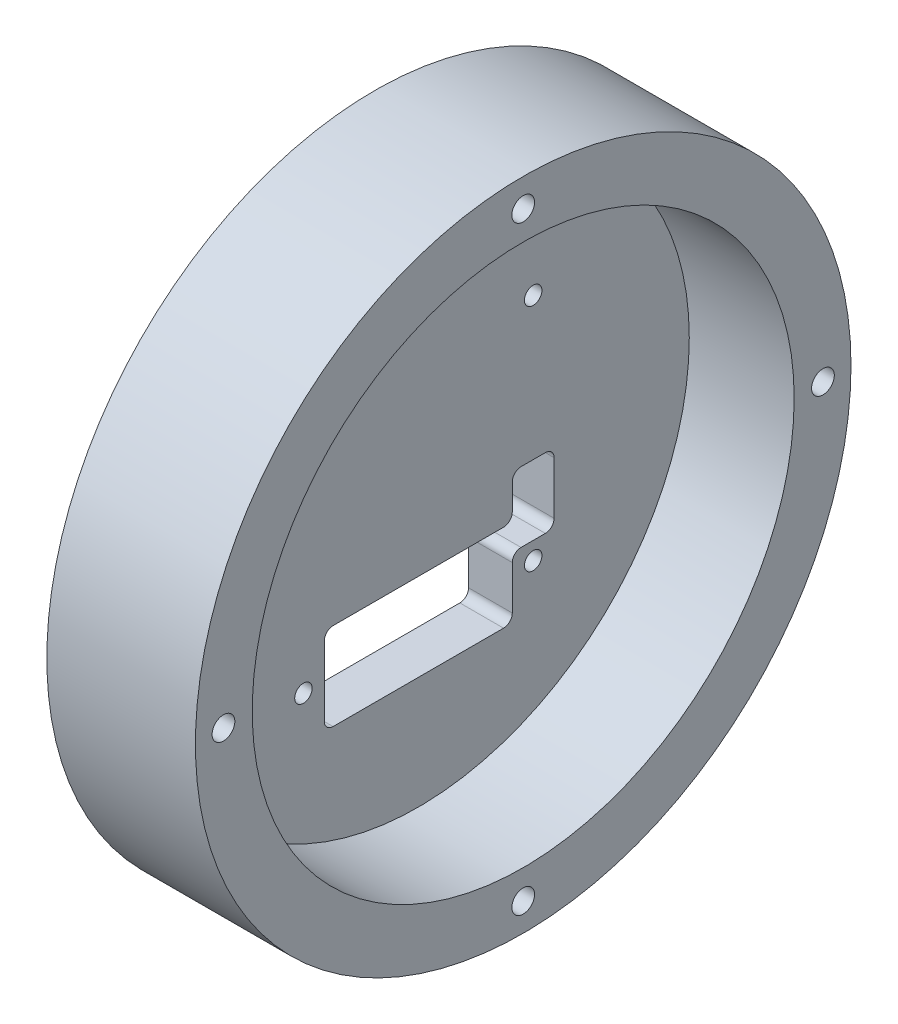
ISO-10303-21;
HEADER;
FILE_DESCRIPTION(('STEP AP214'),'2;1');
FILE_NAME('part.step','',(''),(''),'','','');
FILE_SCHEMA(('AUTOMOTIVE_DESIGN { 1 0 10303 214 1 1 1 1 }'));
ENDSEC;
DATA;
#1=APPLICATION_CONTEXT('core data for automotive mechanical design processes');
#2=APPLICATION_PROTOCOL_DEFINITION('international standard','automotive_design',2000,#1);
#3=PRODUCT_CONTEXT('',#1,'mechanical');
#4=PRODUCT('Part','Part','',(#3));
#5=PRODUCT_RELATED_PRODUCT_CATEGORY('part','',(#4));
#6=PRODUCT_DEFINITION_FORMATION('','',#4);
#7=PRODUCT_DEFINITION_CONTEXT('part definition',#1,'design');
#8=PRODUCT_DEFINITION('design','',#6,#7);
#9=PRODUCT_DEFINITION_SHAPE('','',#8);
#10=(LENGTH_UNIT() NAMED_UNIT(*) SI_UNIT(.MILLI.,.METRE.));
#11=(NAMED_UNIT(*) PLANE_ANGLE_UNIT() SI_UNIT($,.RADIAN.));
#12=(NAMED_UNIT(*) SI_UNIT($,.STERADIAN.) SOLID_ANGLE_UNIT());
#13=UNCERTAINTY_MEASURE_WITH_UNIT(LENGTH_MEASURE(1.E-05),#10,'distance_accuracy_value','');
#14=(GEOMETRIC_REPRESENTATION_CONTEXT(3) GLOBAL_UNCERTAINTY_ASSIGNED_CONTEXT((#13)) GLOBAL_UNIT_ASSIGNED_CONTEXT((#10,
#11,#12)) REPRESENTATION_CONTEXT('',''));
#15=CARTESIAN_POINT('',(0.,0.,0.));
#16=DIRECTION('',(0.,0.,1.));
#17=DIRECTION('',(1.,0.,0.));
#18=AXIS2_PLACEMENT_3D('',#15,#16,#17);
#19=CARTESIAN_POINT('',(5.,0.,0.));
#20=DIRECTION('',(1.,0.,0.));
#21=DIRECTION('',(0.,0.,-1.));
#22=AXIS2_PLACEMENT_3D('',#19,#20,#21);
#23=PLANE('',#22);
#24=CARTESIAN_POINT('',(5.,-12.14,-11.7499999999993));
#25=DIRECTION('',(-1.,0.,0.));
#26=DIRECTION('',(0.,0.,-1.));
#27=AXIS2_PLACEMENT_3D('',#24,#25,#26);
#28=CIRCLE('',#27,0.999999999999999);
#29=CARTESIAN_POINT('',(5.,-12.14,-10.7499999999993));
#30=VERTEX_POINT('',#29);
#31=CARTESIAN_POINT('',(5.,-11.14,-11.7499999999993));
#32=VERTEX_POINT('',#31);
#33=EDGE_CURVE('E49',#30,#32,#28,.T.);
#34=ORIENTED_EDGE('',*,*,#33,.F.);
#35=DIRECTION('',(0.,1.,0.));
#36=VECTOR('',#35,1.);
#37=CARTESIAN_POINT('',(5.,-12.14,-10.7499999999993));
#38=LINE('',#37,#36);
#39=CARTESIAN_POINT('',(5.,-17.14,-10.7499999999993));
#40=VERTEX_POINT('',#39);
#41=EDGE_CURVE('E166',#40,#30,#38,.T.);
#42=ORIENTED_EDGE('',*,*,#41,.F.);
#43=CARTESIAN_POINT('',(5.,-17.14,-9.74999999999926));
#44=DIRECTION('',(1.,0.,0.));
#45=DIRECTION('',(0.,0.,1.));
#46=AXIS2_PLACEMENT_3D('',#43,#44,#45);
#47=CIRCLE('',#46,1.);
#48=CARTESIAN_POINT('',(5.,-18.14,-9.74999999999926));
#49=VERTEX_POINT('',#48);
#50=EDGE_CURVE('E169',#49,#40,#47,.T.);
#51=ORIENTED_EDGE('',*,*,#50,.F.);
#52=DIRECTION('',(0.,0.,-1.));
#53=VECTOR('',#52,1.);
#54=CARTESIAN_POINT('',(5.,-18.14,-9.74999999999926));
#55=LINE('',#54,#53);
#56=CARTESIAN_POINT('',(5.,-18.14,9.75000000000074));
#57=VERTEX_POINT('',#56);
#58=EDGE_CURVE('E245',#57,#49,#55,.T.);
#59=ORIENTED_EDGE('',*,*,#58,.F.);
#60=CARTESIAN_POINT('',(5.,-17.14,9.75000000000074));
#61=DIRECTION('',(1.,0.,0.));
#62=DIRECTION('',(0.,0.,1.));
#63=AXIS2_PLACEMENT_3D('',#60,#61,#62);
#64=CIRCLE('',#63,1.);
#65=CARTESIAN_POINT('',(5.,-17.14,10.7500000000007));
#66=VERTEX_POINT('',#65);
#67=EDGE_CURVE('E242',#66,#57,#64,.T.);
#68=ORIENTED_EDGE('',*,*,#67,.F.);
#69=DIRECTION('',(0.,-1.,0.));
#70=VECTOR('',#69,1.);
#71=CARTESIAN_POINT('',(5.,-9.14,10.7500000000007));
#72=LINE('',#71,#70);
#73=CARTESIAN_POINT('',(5.,-9.14,10.7500000000007));
#74=VERTEX_POINT('',#73);
#75=EDGE_CURVE('E239',#74,#66,#72,.T.);
#76=ORIENTED_EDGE('',*,*,#75,.F.);
#77=CARTESIAN_POINT('',(5.,-9.14,9.75000000000074));
#78=DIRECTION('',(1.,0.,0.));
#79=DIRECTION('',(0.,0.,1.));
#80=AXIS2_PLACEMENT_3D('',#77,#78,#79);
#81=CIRCLE('',#80,0.999999999999997);
#82=CARTESIAN_POINT('',(5.,-8.14,9.75000000000074));
#83=VERTEX_POINT('',#82);
#84=EDGE_CURVE('E236',#83,#74,#81,.T.);
#85=ORIENTED_EDGE('',*,*,#84,.F.);
#86=DIRECTION('',(0.,0.,1.));
#87=VECTOR('',#86,1.);
#88=CARTESIAN_POINT('',(5.,-8.14,-9.74999999999926));
#89=LINE('',#88,#87);
#90=CARTESIAN_POINT('',(5.,-8.14,-9.74999999999926));
#91=VERTEX_POINT('',#90);
#92=EDGE_CURVE('E233',#91,#83,#89,.T.);
#93=ORIENTED_EDGE('',*,*,#92,.F.);
#94=CARTESIAN_POINT('',(5.,-7.14,-9.74999999999926));
#95=DIRECTION('',(-1.,0.,0.));
#96=DIRECTION('',(0.,0.,-1.));
#97=AXIS2_PLACEMENT_3D('',#94,#95,#96);
#98=CIRCLE('',#97,1.);
#99=CARTESIAN_POINT('',(5.,-7.14,-10.7499999999993));
#100=VERTEX_POINT('',#99);
#101=EDGE_CURVE('E230',#100,#91,#98,.T.);
#102=ORIENTED_EDGE('',*,*,#101,.F.);
#103=DIRECTION('',(0.,-1.,0.));
#104=VECTOR('',#103,1.);
#105=CARTESIAN_POINT('',(5.,-4.14,-10.7499999999993));
#106=LINE('',#105,#104);
#107=CARTESIAN_POINT('',(5.,-4.14,-10.7499999999993));
#108=VERTEX_POINT('',#107);
#109=EDGE_CURVE('E227',#108,#100,#106,.T.);
#110=ORIENTED_EDGE('',*,*,#109,.F.);
#111=CARTESIAN_POINT('',(5.,-4.14,-11.7499999999993));
#112=DIRECTION('',(1.,0.,0.));
#113=DIRECTION('',(0.,0.,1.));
#114=AXIS2_PLACEMENT_3D('',#111,#112,#113);
#115=CIRCLE('',#114,1.);
#116=CARTESIAN_POINT('',(5.,-3.14,-11.7499999999993));
#117=VERTEX_POINT('',#116);
#118=EDGE_CURVE('E224',#117,#108,#115,.T.);
#119=ORIENTED_EDGE('',*,*,#118,.F.);
#120=DIRECTION('',(0.,0.,1.));
#121=VECTOR('',#120,1.);
#122=CARTESIAN_POINT('',(5.,-3.14,-14.5299999999993));
#123=LINE('',#122,#121);
#124=CARTESIAN_POINT('',(5.,-3.14,-14.5299999999993));
#125=VERTEX_POINT('',#124);
#126=EDGE_CURVE('E221',#125,#117,#123,.T.);
#127=ORIENTED_EDGE('',*,*,#126,.F.);
#128=CARTESIAN_POINT('',(5.,-4.14,-14.5299999999993));
#129=DIRECTION('',(1.,0.,0.));
#130=DIRECTION('',(0.,0.,-1.));
#131=AXIS2_PLACEMENT_3D('',#128,#129,#130);
#132=CIRCLE('',#131,1.);
#133=CARTESIAN_POINT('',(5.,-4.14,-15.5299999999993));
#134=VERTEX_POINT('',#133);
#135=EDGE_CURVE('E218',#134,#125,#132,.T.);
#136=ORIENTED_EDGE('',*,*,#135,.F.);
#137=DIRECTION('',(0.,1.,0.));
#138=VECTOR('',#137,1.);
#139=CARTESIAN_POINT('',(5.,-4.14,-15.5299999999993));
#140=LINE('',#139,#138);
#141=CARTESIAN_POINT('',(5.,-10.14,-15.5299999999993));
#142=VERTEX_POINT('',#141);
#143=EDGE_CURVE('E215',#142,#134,#140,.T.);
#144=ORIENTED_EDGE('',*,*,#143,.F.);
#145=CARTESIAN_POINT('',(5.,-10.14,-14.5299999999993));
#146=DIRECTION('',(1.,0.,0.));
#147=DIRECTION('',(0.,0.,1.));
#148=AXIS2_PLACEMENT_3D('',#145,#146,#147);
#149=CIRCLE('',#148,0.999999999999999);
#150=CARTESIAN_POINT('',(5.,-11.14,-14.5299999999993));
#151=VERTEX_POINT('',#150);
#152=EDGE_CURVE('E212',#151,#142,#149,.T.);
#153=ORIENTED_EDGE('',*,*,#152,.F.);
#154=DIRECTION('',(0.,0.,-1.));
#155=VECTOR('',#154,1.);
#156=CARTESIAN_POINT('',(5.,-11.14,-14.5299999999993));
#157=LINE('',#156,#155);
#158=EDGE_CURVE('E210',#32,#151,#157,.T.);
#159=ORIENTED_EDGE('',*,*,#158,.F.);
#160=EDGE_LOOP('',(#34,#42,#51,#59,#68,#76,#85,#93,#102,#110,#119,#127,#136,#144,#153,#159));
#161=FACE_BOUND('',#160,.T.);
#162=CARTESIAN_POINT('',(5.,13.14,-13.14));
#163=DIRECTION('',(-1.,0.,0.));
#164=DIRECTION('',(0.,0.,1.));
#165=AXIS2_PLACEMENT_3D('',#162,#163,#164);
#166=CIRCLE('',#165,1.);
#167=CARTESIAN_POINT('',(5.,13.14,-12.14));
#168=VERTEX_POINT('',#167);
#169=EDGE_CURVE('E328',#168,#168,#166,.T.);
#170=ORIENTED_EDGE('',*,*,#169,.T.);
#171=EDGE_LOOP('',(#170));
#172=FACE_BOUND('',#171,.T.);
#173=CARTESIAN_POINT('',(5.,13.1400000000007,13.14));
#174=DIRECTION('',(-1.,0.,0.));
#175=DIRECTION('',(0.,0.,1.));
#176=AXIS2_PLACEMENT_3D('',#173,#174,#175);
#177=CIRCLE('',#176,1.00000000000076);
#178=CARTESIAN_POINT('',(5.,13.1400000000007,14.1400000000008));
#179=VERTEX_POINT('',#178);
#180=EDGE_CURVE('E310',#179,#179,#177,.T.);
#181=ORIENTED_EDGE('',*,*,#180,.T.);
#182=EDGE_LOOP('',(#181));
#183=FACE_BOUND('',#182,.T.);
#184=CARTESIAN_POINT('',(5.,-13.1399999999993,13.1400000000007));
#185=DIRECTION('',(-1.,0.,0.));
#186=DIRECTION('',(0.,0.,1.));
#187=AXIS2_PLACEMENT_3D('',#184,#185,#186);
#188=CIRCLE('',#187,1.00000000000104);
#189=CARTESIAN_POINT('',(5.,-13.1399999999993,14.1400000000018));
#190=VERTEX_POINT('',#189);
#191=EDGE_CURVE('E317',#190,#190,#188,.T.);
#192=ORIENTED_EDGE('',*,*,#191,.T.);
#193=EDGE_LOOP('',(#192));
#194=FACE_BOUND('',#193,.T.);
#195=CARTESIAN_POINT('',(5.,-13.14,-13.1399999999993));
#196=DIRECTION('',(-1.,0.,0.));
#197=DIRECTION('',(0.,0.,1.));
#198=AXIS2_PLACEMENT_3D('',#195,#196,#197);
#199=CIRCLE('',#198,1.00000000000039);
#200=CARTESIAN_POINT('',(5.,-13.14,-12.1399999999989));
#201=VERTEX_POINT('',#200);
#202=EDGE_CURVE('E323',#201,#201,#199,.T.);
#203=ORIENTED_EDGE('',*,*,#202,.T.);
#204=EDGE_LOOP('',(#203));
#205=FACE_BOUND('',#204,.T.);
#206=CARTESIAN_POINT('',(5.,0.,0.));
#207=DIRECTION('',(1.,0.,0.));
#208=DIRECTION('',(0.,0.,-1.));
#209=AXIS2_PLACEMENT_3D('',#206,#207,#208);
#210=CIRCLE('',#209,31.);
#211=CARTESIAN_POINT('',(5.,0.,-31.));
#212=VERTEX_POINT('',#211);
#213=EDGE_CURVE('E12',#212,#212,#210,.F.);
#214=ORIENTED_EDGE('',*,*,#213,.F.);
#215=EDGE_LOOP('',(#214));
#216=FACE_BOUND('',#215,.T.);
#217=ADVANCED_FACE('F34',(#161,#172,#183,#194,#205,#216),#23,.T.);
#218=CARTESIAN_POINT('',(5.,0.,0.));
#219=DIRECTION('',(-1.,0.,0.));
#220=DIRECTION('',(0.,0.,1.));
#221=AXIS2_PLACEMENT_3D('',#218,#219,#220);
#222=CYLINDRICAL_SURFACE('',#221,37.5);
#223=CARTESIAN_POINT('',(0.,0.,0.));
#224=DIRECTION('',(1.,0.,0.));
#225=DIRECTION('',(0.,0.,-1.));
#226=AXIS2_PLACEMENT_3D('',#223,#224,#225);
#227=CIRCLE('',#226,37.5);
#228=CARTESIAN_POINT('',(0.,0.,-37.5));
#229=VERTEX_POINT('',#228);
#230=EDGE_CURVE('E42',#229,#229,#227,.T.);
#231=ORIENTED_EDGE('',*,*,#230,.T.);
#232=EDGE_LOOP('',(#231));
#233=FACE_BOUND('',#232,.T.);
#234=CARTESIAN_POINT('',(17.,0.,0.));
#235=DIRECTION('',(1.,0.,0.));
#236=DIRECTION('',(0.,0.,-1.));
#237=AXIS2_PLACEMENT_3D('',#234,#235,#236);
#238=CIRCLE('',#237,37.5);
#239=CARTESIAN_POINT('',(17.,0.,-37.5));
#240=VERTEX_POINT('',#239);
#241=EDGE_CURVE('E306',#240,#240,#238,.T.);
#242=ORIENTED_EDGE('',*,*,#241,.F.);
#243=EDGE_LOOP('',(#242));
#244=FACE_BOUND('',#243,.T.);
#245=ADVANCED_FACE('F36',(#233,#244),#222,.T.);
#246=CARTESIAN_POINT('',(0.,0.,0.));
#247=DIRECTION('',(1.,0.,0.));
#248=DIRECTION('',(0.,0.,-1.));
#249=AXIS2_PLACEMENT_3D('',#246,#247,#248);
#250=PLANE('',#249);
#251=DIRECTION('',(0.,1.,0.));
#252=VECTOR('',#251,1.);
#253=CARTESIAN_POINT('',(0.,-12.14,-10.7499999999993));
#254=LINE('',#253,#252);
#255=CARTESIAN_POINT('',(0.,-17.14,-10.7499999999993));
#256=VERTEX_POINT('',#255);
#257=CARTESIAN_POINT('',(0.,-12.14,-10.7499999999993));
#258=VERTEX_POINT('',#257);
#259=EDGE_CURVE('E155',#256,#258,#254,.T.);
#260=ORIENTED_EDGE('',*,*,#259,.T.);
#261=CARTESIAN_POINT('',(0.,-12.14,-11.7499999999993));
#262=DIRECTION('',(-1.,0.,0.));
#263=DIRECTION('',(0.,0.,-1.));
#264=AXIS2_PLACEMENT_3D('',#261,#262,#263);
#265=CIRCLE('',#264,0.999999999999999);
#266=CARTESIAN_POINT('',(0.,-11.14,-11.7499999999993));
#267=VERTEX_POINT('',#266);
#268=EDGE_CURVE('E149',#258,#267,#265,.T.);
#269=ORIENTED_EDGE('',*,*,#268,.T.);
#270=DIRECTION('',(0.,0.,-1.));
#271=VECTOR('',#270,1.);
#272=CARTESIAN_POINT('',(0.,-11.14,-14.5299999999993));
#273=LINE('',#272,#271);
#274=CARTESIAN_POINT('',(0.,-11.14,-14.5299999999993));
#275=VERTEX_POINT('',#274);
#276=EDGE_CURVE('E158',#267,#275,#273,.T.);
#277=ORIENTED_EDGE('',*,*,#276,.T.);
#278=CARTESIAN_POINT('',(0.,-10.14,-14.5299999999993));
#279=DIRECTION('',(1.,0.,0.));
#280=DIRECTION('',(0.,0.,1.));
#281=AXIS2_PLACEMENT_3D('',#278,#279,#280);
#282=CIRCLE('',#281,0.999999999999999);
#283=CARTESIAN_POINT('',(0.,-10.14,-15.5299999999993));
#284=VERTEX_POINT('',#283);
#285=EDGE_CURVE('E57',#275,#284,#282,.T.);
#286=ORIENTED_EDGE('',*,*,#285,.T.);
#287=DIRECTION('',(0.,1.,0.));
#288=VECTOR('',#287,1.);
#289=CARTESIAN_POINT('',(0.,-4.14,-15.5299999999993));
#290=LINE('',#289,#288);
#291=CARTESIAN_POINT('',(0.,-4.14,-15.5299999999993));
#292=VERTEX_POINT('',#291);
#293=EDGE_CURVE('E173',#284,#292,#290,.T.);
#294=ORIENTED_EDGE('',*,*,#293,.T.);
#295=CARTESIAN_POINT('',(0.,-4.14,-14.5299999999993));
#296=DIRECTION('',(1.,0.,0.));
#297=DIRECTION('',(0.,0.,-1.));
#298=AXIS2_PLACEMENT_3D('',#295,#296,#297);
#299=CIRCLE('',#298,1.);
#300=CARTESIAN_POINT('',(0.,-3.14,-14.5299999999993));
#301=VERTEX_POINT('',#300);
#302=EDGE_CURVE('E176',#292,#301,#299,.T.);
#303=ORIENTED_EDGE('',*,*,#302,.T.);
#304=DIRECTION('',(0.,0.,1.));
#305=VECTOR('',#304,1.);
#306=CARTESIAN_POINT('',(0.,-3.14,-14.5299999999993));
#307=LINE('',#306,#305);
#308=CARTESIAN_POINT('',(0.,-3.14,-11.7499999999993));
#309=VERTEX_POINT('',#308);
#310=EDGE_CURVE('E179',#301,#309,#307,.T.);
#311=ORIENTED_EDGE('',*,*,#310,.T.);
#312=CARTESIAN_POINT('',(0.,-4.14,-11.7499999999993));
#313=DIRECTION('',(1.,0.,0.));
#314=DIRECTION('',(0.,0.,1.));
#315=AXIS2_PLACEMENT_3D('',#312,#313,#314);
#316=CIRCLE('',#315,1.);
#317=CARTESIAN_POINT('',(0.,-4.14,-10.7499999999993));
#318=VERTEX_POINT('',#317);
#319=EDGE_CURVE('E182',#309,#318,#316,.T.);
#320=ORIENTED_EDGE('',*,*,#319,.T.);
#321=DIRECTION('',(0.,-1.,0.));
#322=VECTOR('',#321,1.);
#323=CARTESIAN_POINT('',(0.,-4.14,-10.7499999999993));
#324=LINE('',#323,#322);
#325=CARTESIAN_POINT('',(0.,-7.14,-10.7499999999993));
#326=VERTEX_POINT('',#325);
#327=EDGE_CURVE('E185',#318,#326,#324,.T.);
#328=ORIENTED_EDGE('',*,*,#327,.T.);
#329=CARTESIAN_POINT('',(0.,-7.14,-9.74999999999926));
#330=DIRECTION('',(-1.,0.,0.));
#331=DIRECTION('',(0.,0.,-1.));
#332=AXIS2_PLACEMENT_3D('',#329,#330,#331);
#333=CIRCLE('',#332,1.);
#334=CARTESIAN_POINT('',(0.,-8.14,-9.74999999999926));
#335=VERTEX_POINT('',#334);
#336=EDGE_CURVE('E188',#326,#335,#333,.T.);
#337=ORIENTED_EDGE('',*,*,#336,.T.);
#338=DIRECTION('',(0.,0.,1.));
#339=VECTOR('',#338,1.);
#340=CARTESIAN_POINT('',(0.,-8.14,-9.74999999999926));
#341=LINE('',#340,#339);
#342=CARTESIAN_POINT('',(0.,-8.14,9.75000000000074));
#343=VERTEX_POINT('',#342);
#344=EDGE_CURVE('E191',#335,#343,#341,.T.);
#345=ORIENTED_EDGE('',*,*,#344,.T.);
#346=CARTESIAN_POINT('',(0.,-9.14,9.75000000000074));
#347=DIRECTION('',(1.,0.,0.));
#348=DIRECTION('',(0.,0.,1.));
#349=AXIS2_PLACEMENT_3D('',#346,#347,#348);
#350=CIRCLE('',#349,0.999999999999997);
#351=CARTESIAN_POINT('',(0.,-9.14,10.7500000000007));
#352=VERTEX_POINT('',#351);
#353=EDGE_CURVE('E194',#343,#352,#350,.T.);
#354=ORIENTED_EDGE('',*,*,#353,.T.);
#355=DIRECTION('',(0.,-1.,0.));
#356=VECTOR('',#355,1.);
#357=CARTESIAN_POINT('',(0.,-9.14,10.7500000000007));
#358=LINE('',#357,#356);
#359=CARTESIAN_POINT('',(0.,-17.14,10.7500000000007));
#360=VERTEX_POINT('',#359);
#361=EDGE_CURVE('E197',#352,#360,#358,.T.);
#362=ORIENTED_EDGE('',*,*,#361,.T.);
#363=CARTESIAN_POINT('',(0.,-17.14,9.75000000000074));
#364=DIRECTION('',(1.,0.,0.));
#365=DIRECTION('',(0.,0.,1.));
#366=AXIS2_PLACEMENT_3D('',#363,#364,#365);
#367=CIRCLE('',#366,1.);
#368=CARTESIAN_POINT('',(0.,-18.14,9.75000000000074));
#369=VERTEX_POINT('',#368);
#370=EDGE_CURVE('E200',#360,#369,#367,.T.);
#371=ORIENTED_EDGE('',*,*,#370,.T.);
#372=DIRECTION('',(0.,0.,-1.));
#373=VECTOR('',#372,1.);
#374=CARTESIAN_POINT('',(0.,-18.14,-9.74999999999926));
#375=LINE('',#374,#373);
#376=CARTESIAN_POINT('',(0.,-18.14,-9.74999999999926));
#377=VERTEX_POINT('',#376);
#378=EDGE_CURVE('E203',#369,#377,#375,.T.);
#379=ORIENTED_EDGE('',*,*,#378,.T.);
#380=CARTESIAN_POINT('',(0.,-17.14,-9.74999999999926));
#381=DIRECTION('',(1.,0.,0.));
#382=DIRECTION('',(0.,0.,1.));
#383=AXIS2_PLACEMENT_3D('',#380,#381,#382);
#384=CIRCLE('',#383,1.);
#385=EDGE_CURVE('E206',#377,#256,#384,.T.);
#386=ORIENTED_EDGE('',*,*,#385,.T.);
#387=EDGE_LOOP('',(#260,#269,#277,#286,#294,#303,#311,#320,#328,#337,#345,#354,#362,#371,#379,#386));
#388=FACE_BOUND('',#387,.T.);
#389=CARTESIAN_POINT('',(0.,34.29,0.));
#390=DIRECTION('',(1.,0.,0.));
#391=DIRECTION('',(0.,0.,-1.));
#392=AXIS2_PLACEMENT_3D('',#389,#390,#391);
#393=CIRCLE('',#392,1.3);
#394=CARTESIAN_POINT('',(0.,34.29,-1.3));
#395=VERTEX_POINT('',#394);
#396=EDGE_CURVE('E283',#395,#395,#393,.T.);
#397=ORIENTED_EDGE('',*,*,#396,.T.);
#398=EDGE_LOOP('',(#397));
#399=FACE_BOUND('',#398,.T.);
#400=CARTESIAN_POINT('',(0.,9.70381102494277E-13,-34.290000000001));
#401=DIRECTION('',(1.,0.,0.));
#402=DIRECTION('',(0.,0.,-1.));
#403=AXIS2_PLACEMENT_3D('',#400,#401,#402);
#404=CIRCLE('',#403,1.30000000000076);
#405=CARTESIAN_POINT('',(0.,9.70381102494277E-13,-35.5900000000017));
#406=VERTEX_POINT('',#405);
#407=EDGE_CURVE('E284',#406,#406,#404,.T.);
#408=ORIENTED_EDGE('',*,*,#407,.T.);
#409=EDGE_LOOP('',(#408));
#410=FACE_BOUND('',#409,.T.);
#411=CARTESIAN_POINT('',(0.,-34.29,-1.94076220498855E-12));
#412=DIRECTION('',(1.,0.,0.));
#413=DIRECTION('',(0.,0.,-1.));
#414=AXIS2_PLACEMENT_3D('',#411,#412,#413);
#415=CIRCLE('',#414,1.30000000000209);
#416=CARTESIAN_POINT('',(0.,-34.29,-1.30000000000403));
#417=VERTEX_POINT('',#416);
#418=EDGE_CURVE('E291',#417,#417,#415,.T.);
#419=ORIENTED_EDGE('',*,*,#418,.T.);
#420=EDGE_LOOP('',(#419));
#421=FACE_BOUND('',#420,.T.);
#422=CARTESIAN_POINT('',(0.,-9.74580416368553E-13,34.289999999999));
#423=DIRECTION('',(1.,0.,0.));
#424=DIRECTION('',(0.,0.,-1.));
#425=AXIS2_PLACEMENT_3D('',#422,#423,#424);
#426=CIRCLE('',#425,1.30000000000156);
#427=CARTESIAN_POINT('',(0.,-9.74580416368553E-13,32.9899999999975));
#428=VERTEX_POINT('',#427);
#429=EDGE_CURVE('E297',#428,#428,#426,.T.);
#430=ORIENTED_EDGE('',*,*,#429,.T.);
#431=EDGE_LOOP('',(#430));
#432=FACE_BOUND('',#431,.T.);
#433=CARTESIAN_POINT('',(0.,-13.14,-13.1399999999993));
#434=DIRECTION('',(-1.,0.,0.));
#435=DIRECTION('',(0.,0.,1.));
#436=AXIS2_PLACEMENT_3D('',#433,#434,#435);
#437=CIRCLE('',#436,1.00000000000039);
#438=CARTESIAN_POINT('',(0.,-13.14,-12.1399999999989));
#439=VERTEX_POINT('',#438);
#440=EDGE_CURVE('E309',#439,#439,#437,.T.);
#441=ORIENTED_EDGE('',*,*,#440,.F.);
#442=EDGE_LOOP('',(#441));
#443=FACE_BOUND('',#442,.T.);
#444=CARTESIAN_POINT('',(0.,-13.1399999999993,13.1400000000007));
#445=DIRECTION('',(-1.,0.,0.));
#446=DIRECTION('',(0.,0.,1.));
#447=AXIS2_PLACEMENT_3D('',#444,#445,#446);
#448=CIRCLE('',#447,1.00000000000104);
#449=CARTESIAN_POINT('',(0.,-13.1399999999993,14.1400000000018));
#450=VERTEX_POINT('',#449);
#451=EDGE_CURVE('E320',#450,#450,#448,.T.);
#452=ORIENTED_EDGE('',*,*,#451,.F.);
#453=EDGE_LOOP('',(#452));
#454=FACE_BOUND('',#453,.T.);
#455=CARTESIAN_POINT('',(0.,13.1400000000007,13.14));
#456=DIRECTION('',(-1.,0.,0.));
#457=DIRECTION('',(0.,0.,1.));
#458=AXIS2_PLACEMENT_3D('',#455,#456,#457);
#459=CIRCLE('',#458,1.00000000000076);
#460=CARTESIAN_POINT('',(0.,13.1400000000007,14.1400000000008));
#461=VERTEX_POINT('',#460);
#462=EDGE_CURVE('E314',#461,#461,#459,.T.);
#463=ORIENTED_EDGE('',*,*,#462,.F.);
#464=EDGE_LOOP('',(#463));
#465=FACE_BOUND('',#464,.T.);
#466=CARTESIAN_POINT('',(0.,13.14,-13.14));
#467=DIRECTION('',(-1.,0.,0.));
#468=DIRECTION('',(0.,0.,1.));
#469=AXIS2_PLACEMENT_3D('',#466,#467,#468);
#470=CIRCLE('',#469,1.);
#471=CARTESIAN_POINT('',(0.,13.14,-12.14));
#472=VERTEX_POINT('',#471);
#473=EDGE_CURVE('E313',#472,#472,#470,.T.);
#474=ORIENTED_EDGE('',*,*,#473,.F.);
#475=EDGE_LOOP('',(#474));
#476=FACE_BOUND('',#475,.T.);
#477=ORIENTED_EDGE('',*,*,#230,.F.);
#478=EDGE_LOOP('',(#477));
#479=FACE_BOUND('',#478,.T.);
#480=ADVANCED_FACE('F162',(#388,#399,#410,#421,#432,#443,#454,#465,#476,#479),#250,.F.);
#481=CARTESIAN_POINT('',(5.,13.14,-13.14));
#482=DIRECTION('',(-1.,0.,0.));
#483=DIRECTION('',(0.,0.,1.));
#484=AXIS2_PLACEMENT_3D('',#481,#482,#483);
#485=CYLINDRICAL_SURFACE('',#484,1.);
#486=ORIENTED_EDGE('',*,*,#169,.F.);
#487=EDGE_LOOP('',(#486));
#488=FACE_BOUND('',#487,.T.);
#489=ORIENTED_EDGE('',*,*,#473,.T.);
#490=EDGE_LOOP('',(#489));
#491=FACE_BOUND('',#490,.T.);
#492=ADVANCED_FACE('F338',(#488,#491),#485,.F.);
#493=CARTESIAN_POINT('',(5.,13.1400000000007,13.14));
#494=DIRECTION('',(-1.,0.,0.));
#495=DIRECTION('',(0.,0.,1.));
#496=AXIS2_PLACEMENT_3D('',#493,#494,#495);
#497=CYLINDRICAL_SURFACE('',#496,1.00000000000076);
#498=ORIENTED_EDGE('',*,*,#180,.F.);
#499=EDGE_LOOP('',(#498));
#500=FACE_BOUND('',#499,.T.);
#501=ORIENTED_EDGE('',*,*,#462,.T.);
#502=EDGE_LOOP('',(#501));
#503=FACE_BOUND('',#502,.T.);
#504=ADVANCED_FACE('F343',(#500,#503),#497,.F.);
#505=CARTESIAN_POINT('',(5.,-13.1399999999993,13.1400000000007));
#506=DIRECTION('',(-1.,0.,0.));
#507=DIRECTION('',(0.,0.,1.));
#508=AXIS2_PLACEMENT_3D('',#505,#506,#507);
#509=CYLINDRICAL_SURFACE('',#508,1.00000000000104);
#510=ORIENTED_EDGE('',*,*,#191,.F.);
#511=EDGE_LOOP('',(#510));
#512=FACE_BOUND('',#511,.T.);
#513=ORIENTED_EDGE('',*,*,#451,.T.);
#514=EDGE_LOOP('',(#513));
#515=FACE_BOUND('',#514,.T.);
#516=ADVANCED_FACE('F357',(#512,#515),#509,.F.);
#517=CARTESIAN_POINT('',(5.,-13.14,-13.1399999999993));
#518=DIRECTION('',(-1.,0.,0.));
#519=DIRECTION('',(0.,0.,1.));
#520=AXIS2_PLACEMENT_3D('',#517,#518,#519);
#521=CYLINDRICAL_SURFACE('',#520,1.00000000000039);
#522=ORIENTED_EDGE('',*,*,#202,.F.);
#523=EDGE_LOOP('',(#522));
#524=FACE_BOUND('',#523,.T.);
#525=ORIENTED_EDGE('',*,*,#440,.T.);
#526=EDGE_LOOP('',(#525));
#527=FACE_BOUND('',#526,.T.);
#528=ADVANCED_FACE('F353',(#524,#527),#521,.F.);
#529=CARTESIAN_POINT('',(17.,0.,0.));
#530=DIRECTION('',(1.,0.,0.));
#531=DIRECTION('',(0.,0.,-1.));
#532=AXIS2_PLACEMENT_3D('',#529,#530,#531);
#533=PLANE('',#532);
#534=CARTESIAN_POINT('',(17.,34.29,0.));
#535=DIRECTION('',(1.,0.,0.));
#536=DIRECTION('',(0.,0.,-1.));
#537=AXIS2_PLACEMENT_3D('',#534,#535,#536);
#538=CIRCLE('',#537,1.3);
#539=CARTESIAN_POINT('',(17.,34.29,-1.3));
#540=VERTEX_POINT('',#539);
#541=EDGE_CURVE('E280',#540,#540,#538,.T.);
#542=ORIENTED_EDGE('',*,*,#541,.F.);
#543=EDGE_LOOP('',(#542));
#544=FACE_BOUND('',#543,.T.);
#545=CARTESIAN_POINT('',(17.,9.70381102494277E-13,-34.290000000001));
#546=DIRECTION('',(1.,0.,0.));
#547=DIRECTION('',(0.,0.,-1.));
#548=AXIS2_PLACEMENT_3D('',#545,#546,#547);
#549=CIRCLE('',#548,1.30000000000076);
#550=CARTESIAN_POINT('',(17.,9.70381102494277E-13,-35.5900000000017));
#551=VERTEX_POINT('',#550);
#552=EDGE_CURVE('E288',#551,#551,#549,.T.);
#553=ORIENTED_EDGE('',*,*,#552,.F.);
#554=EDGE_LOOP('',(#553));
#555=FACE_BOUND('',#554,.T.);
#556=CARTESIAN_POINT('',(17.,-34.29,-1.94076220498855E-12));
#557=DIRECTION('',(1.,0.,0.));
#558=DIRECTION('',(0.,0.,-1.));
#559=AXIS2_PLACEMENT_3D('',#556,#557,#558);
#560=CIRCLE('',#559,1.30000000000209);
#561=CARTESIAN_POINT('',(17.,-34.29,-1.30000000000403));
#562=VERTEX_POINT('',#561);
#563=EDGE_CURVE('E294',#562,#562,#560,.T.);
#564=ORIENTED_EDGE('',*,*,#563,.F.);
#565=EDGE_LOOP('',(#564));
#566=FACE_BOUND('',#565,.T.);
#567=CARTESIAN_POINT('',(17.,-9.74580416368553E-13,34.289999999999));
#568=DIRECTION('',(1.,0.,0.));
#569=DIRECTION('',(0.,0.,-1.));
#570=AXIS2_PLACEMENT_3D('',#567,#568,#569);
#571=CIRCLE('',#570,1.30000000000156);
#572=CARTESIAN_POINT('',(17.,-9.74580416368553E-13,32.9899999999975));
#573=VERTEX_POINT('',#572);
#574=EDGE_CURVE('E252',#573,#573,#571,.T.);
#575=ORIENTED_EDGE('',*,*,#574,.F.);
#576=EDGE_LOOP('',(#575));
#577=FACE_BOUND('',#576,.T.);
#578=ORIENTED_EDGE('',*,*,#241,.T.);
#579=EDGE_LOOP('',(#578));
#580=FACE_BOUND('',#579,.T.);
#581=CARTESIAN_POINT('',(17.,0.,0.));
#582=DIRECTION('',(1.,0.,0.));
#583=DIRECTION('',(0.,0.,-1.));
#584=AXIS2_PLACEMENT_3D('',#581,#582,#583);
#585=CIRCLE('',#584,31.);
#586=CARTESIAN_POINT('',(17.,0.,-31.));
#587=VERTEX_POINT('',#586);
#588=EDGE_CURVE('E287',#587,#587,#585,.T.);
#589=ORIENTED_EDGE('',*,*,#588,.F.);
#590=EDGE_LOOP('',(#589));
#591=FACE_BOUND('',#590,.T.);
#592=ADVANCED_FACE('F356',(#544,#555,#566,#577,#580,#591),#533,.T.);
#593=CARTESIAN_POINT('',(17.,0.,0.));
#594=DIRECTION('',(-1.,0.,0.));
#595=DIRECTION('',(0.,0.,1.));
#596=AXIS2_PLACEMENT_3D('',#593,#594,#595);
#597=CYLINDRICAL_SURFACE('',#596,31.);
#598=ORIENTED_EDGE('',*,*,#588,.T.);
#599=EDGE_LOOP('',(#598));
#600=FACE_BOUND('',#599,.T.);
#601=ORIENTED_EDGE('',*,*,#213,.T.);
#602=EDGE_LOOP('',(#601));
#603=FACE_BOUND('',#602,.T.);
#604=ADVANCED_FACE('F367',(#600,#603),#597,.F.);
#605=CARTESIAN_POINT('',(0.,-9.74580416368553E-13,34.289999999999));
#606=DIRECTION('',(1.,0.,0.));
#607=DIRECTION('',(0.,0.,-1.));
#608=AXIS2_PLACEMENT_3D('',#605,#606,#607);
#609=CYLINDRICAL_SURFACE('',#608,1.30000000000156);
#610=ORIENTED_EDGE('',*,*,#429,.F.);
#611=EDGE_LOOP('',(#610));
#612=FACE_BOUND('',#611,.T.);
#613=ORIENTED_EDGE('',*,*,#574,.T.);
#614=EDGE_LOOP('',(#613));
#615=FACE_BOUND('',#614,.T.);
#616=ADVANCED_FACE('F371',(#612,#615),#609,.F.);
#617=CARTESIAN_POINT('',(0.,-34.29,-1.94076220498855E-12));
#618=DIRECTION('',(1.,0.,0.));
#619=DIRECTION('',(0.,0.,-1.));
#620=AXIS2_PLACEMENT_3D('',#617,#618,#619);
#621=CYLINDRICAL_SURFACE('',#620,1.30000000000209);
#622=ORIENTED_EDGE('',*,*,#418,.F.);
#623=EDGE_LOOP('',(#622));
#624=FACE_BOUND('',#623,.T.);
#625=ORIENTED_EDGE('',*,*,#563,.T.);
#626=EDGE_LOOP('',(#625));
#627=FACE_BOUND('',#626,.T.);
#628=ADVANCED_FACE('F375',(#624,#627),#621,.F.);
#629=CARTESIAN_POINT('',(0.,9.70381102494277E-13,-34.290000000001));
#630=DIRECTION('',(1.,0.,0.));
#631=DIRECTION('',(0.,0.,-1.));
#632=AXIS2_PLACEMENT_3D('',#629,#630,#631);
#633=CYLINDRICAL_SURFACE('',#632,1.30000000000076);
#634=ORIENTED_EDGE('',*,*,#407,.F.);
#635=EDGE_LOOP('',(#634));
#636=FACE_BOUND('',#635,.T.);
#637=ORIENTED_EDGE('',*,*,#552,.T.);
#638=EDGE_LOOP('',(#637));
#639=FACE_BOUND('',#638,.T.);
#640=ADVANCED_FACE('F379',(#636,#639),#633,.F.);
#641=CARTESIAN_POINT('',(0.,34.29,0.));
#642=DIRECTION('',(1.,0.,0.));
#643=DIRECTION('',(0.,0.,-1.));
#644=AXIS2_PLACEMENT_3D('',#641,#642,#643);
#645=CYLINDRICAL_SURFACE('',#644,1.3);
#646=ORIENTED_EDGE('',*,*,#396,.F.);
#647=EDGE_LOOP('',(#646));
#648=FACE_BOUND('',#647,.T.);
#649=ORIENTED_EDGE('',*,*,#541,.T.);
#650=EDGE_LOOP('',(#649));
#651=FACE_BOUND('',#650,.T.);
#652=ADVANCED_FACE('F383',(#648,#651),#645,.F.);
#653=CARTESIAN_POINT('',(0.,-12.14,-11.7499999999993));
#654=DIRECTION('',(1.,0.,0.));
#655=DIRECTION('',(0.,0.,-1.));
#656=AXIS2_PLACEMENT_3D('',#653,#654,#655);
#657=CYLINDRICAL_SURFACE('',#656,0.999999999999999);
#658=ORIENTED_EDGE('',*,*,#33,.T.);
#659=DIRECTION('',(1.,0.,0.));
#660=VECTOR('',#659,1.);
#661=CARTESIAN_POINT('',(0.,-11.14,-11.7499999999993));
#662=LINE('',#661,#660);
#663=EDGE_CURVE('E145',#267,#32,#662,.T.);
#664=ORIENTED_EDGE('',*,*,#663,.F.);
#665=ORIENTED_EDGE('',*,*,#268,.F.);
#666=DIRECTION('',(1.,0.,0.));
#667=VECTOR('',#666,1.);
#668=CARTESIAN_POINT('',(0.,-12.14,-10.7499999999993));
#669=LINE('',#668,#667);
#670=EDGE_CURVE('E250',#258,#30,#669,.T.);
#671=ORIENTED_EDGE('',*,*,#670,.T.);
#672=EDGE_LOOP('',(#658,#664,#665,#671));
#673=FACE_BOUND('',#672,.T.);
#674=ADVANCED_FACE('F147',(#673),#657,.T.);
#675=CARTESIAN_POINT('',(0.,-12.14,-10.7499999999993));
#676=DIRECTION('',(0.,0.,-1.));
#677=DIRECTION('',(-1.,0.,0.));
#678=AXIS2_PLACEMENT_3D('',#675,#676,#677);
#679=PLANE('',#678);
#680=ORIENTED_EDGE('',*,*,#41,.T.);
#681=ORIENTED_EDGE('',*,*,#670,.F.);
#682=ORIENTED_EDGE('',*,*,#259,.F.);
#683=DIRECTION('',(1.,0.,0.));
#684=VECTOR('',#683,1.);
#685=CARTESIAN_POINT('',(0.,-17.14,-10.7499999999993));
#686=LINE('',#685,#684);
#687=EDGE_CURVE('E253',#256,#40,#686,.T.);
#688=ORIENTED_EDGE('',*,*,#687,.T.);
#689=EDGE_LOOP('',(#680,#681,#682,#688));
#690=FACE_BOUND('',#689,.T.);
#691=ADVANCED_FACE('F390',(#690),#679,.F.);
#692=CARTESIAN_POINT('',(0.,-17.14,-9.74999999999926));
#693=DIRECTION('',(1.,0.,0.));
#694=DIRECTION('',(0.,0.,-1.));
#695=AXIS2_PLACEMENT_3D('',#692,#693,#694);
#696=CYLINDRICAL_SURFACE('',#695,1.);
#697=ORIENTED_EDGE('',*,*,#50,.T.);
#698=ORIENTED_EDGE('',*,*,#687,.F.);
#699=ORIENTED_EDGE('',*,*,#385,.F.);
#700=DIRECTION('',(1.,0.,0.));
#701=VECTOR('',#700,1.);
#702=CARTESIAN_POINT('',(0.,-18.14,-9.74999999999926));
#703=LINE('',#702,#701);
#704=EDGE_CURVE('E255',#377,#49,#703,.T.);
#705=ORIENTED_EDGE('',*,*,#704,.T.);
#706=EDGE_LOOP('',(#697,#698,#699,#705));
#707=FACE_BOUND('',#706,.T.);
#708=ADVANCED_FACE('F439',(#707),#696,.F.);
#709=CARTESIAN_POINT('',(0.,-18.14,-9.74999999999926));
#710=DIRECTION('',(0.,-1.,0.));
#711=DIRECTION('',(0.,0.,-1.));
#712=AXIS2_PLACEMENT_3D('',#709,#710,#711);
#713=PLANE('',#712);
#714=ORIENTED_EDGE('',*,*,#58,.T.);
#715=ORIENTED_EDGE('',*,*,#704,.F.);
#716=ORIENTED_EDGE('',*,*,#378,.F.);
#717=DIRECTION('',(1.,0.,0.));
#718=VECTOR('',#717,1.);
#719=CARTESIAN_POINT('',(0.,-18.14,9.75000000000074));
#720=LINE('',#719,#718);
#721=EDGE_CURVE('E257',#369,#57,#720,.T.);
#722=ORIENTED_EDGE('',*,*,#721,.T.);
#723=EDGE_LOOP('',(#714,#715,#716,#722));
#724=FACE_BOUND('',#723,.T.);
#725=ADVANCED_FACE('F435',(#724),#713,.F.);
#726=CARTESIAN_POINT('',(0.,-17.14,9.75000000000074));
#727=DIRECTION('',(1.,0.,0.));
#728=DIRECTION('',(0.,0.,-1.));
#729=AXIS2_PLACEMENT_3D('',#726,#727,#728);
#730=CYLINDRICAL_SURFACE('',#729,1.);
#731=ORIENTED_EDGE('',*,*,#67,.T.);
#732=ORIENTED_EDGE('',*,*,#721,.F.);
#733=ORIENTED_EDGE('',*,*,#370,.F.);
#734=DIRECTION('',(1.,0.,0.));
#735=VECTOR('',#734,1.);
#736=CARTESIAN_POINT('',(0.,-17.14,10.7500000000007));
#737=LINE('',#736,#735);
#738=EDGE_CURVE('E259',#360,#66,#737,.T.);
#739=ORIENTED_EDGE('',*,*,#738,.T.);
#740=EDGE_LOOP('',(#731,#732,#733,#739));
#741=FACE_BOUND('',#740,.T.);
#742=ADVANCED_FACE('F431',(#741),#730,.F.);
#743=CARTESIAN_POINT('',(0.,-9.14,10.7500000000007));
#744=DIRECTION('',(0.,0.,1.));
#745=DIRECTION('',(0.,-1.,0.));
#746=AXIS2_PLACEMENT_3D('',#743,#744,#745);
#747=PLANE('',#746);
#748=ORIENTED_EDGE('',*,*,#75,.T.);
#749=ORIENTED_EDGE('',*,*,#738,.F.);
#750=ORIENTED_EDGE('',*,*,#361,.F.);
#751=DIRECTION('',(1.,0.,0.));
#752=VECTOR('',#751,1.);
#753=CARTESIAN_POINT('',(0.,-9.14,10.7500000000007));
#754=LINE('',#753,#752);
#755=EDGE_CURVE('E261',#352,#74,#754,.T.);
#756=ORIENTED_EDGE('',*,*,#755,.T.);
#757=EDGE_LOOP('',(#748,#749,#750,#756));
#758=FACE_BOUND('',#757,.T.);
#759=ADVANCED_FACE('F427',(#758),#747,.F.);
#760=CARTESIAN_POINT('',(0.,-9.14,9.75000000000074));
#761=DIRECTION('',(1.,0.,0.));
#762=DIRECTION('',(0.,0.,-1.));
#763=AXIS2_PLACEMENT_3D('',#760,#761,#762);
#764=CYLINDRICAL_SURFACE('',#763,0.999999999999997);
#765=ORIENTED_EDGE('',*,*,#84,.T.);
#766=ORIENTED_EDGE('',*,*,#755,.F.);
#767=ORIENTED_EDGE('',*,*,#353,.F.);
#768=DIRECTION('',(1.,0.,0.));
#769=VECTOR('',#768,1.);
#770=CARTESIAN_POINT('',(0.,-8.14,9.75000000000074));
#771=LINE('',#770,#769);
#772=EDGE_CURVE('E263',#343,#83,#771,.T.);
#773=ORIENTED_EDGE('',*,*,#772,.T.);
#774=EDGE_LOOP('',(#765,#766,#767,#773));
#775=FACE_BOUND('',#774,.T.);
#776=ADVANCED_FACE('F423',(#775),#764,.F.);
#777=CARTESIAN_POINT('',(0.,-8.14,-9.74999999999926));
#778=DIRECTION('',(0.,1.,0.));
#779=DIRECTION('',(0.,0.,1.));
#780=AXIS2_PLACEMENT_3D('',#777,#778,#779);
#781=PLANE('',#780);
#782=ORIENTED_EDGE('',*,*,#92,.T.);
#783=ORIENTED_EDGE('',*,*,#772,.F.);
#784=ORIENTED_EDGE('',*,*,#344,.F.);
#785=DIRECTION('',(1.,0.,0.));
#786=VECTOR('',#785,1.);
#787=CARTESIAN_POINT('',(0.,-8.14,-9.74999999999926));
#788=LINE('',#787,#786);
#789=EDGE_CURVE('E265',#335,#91,#788,.T.);
#790=ORIENTED_EDGE('',*,*,#789,.T.);
#791=EDGE_LOOP('',(#782,#783,#784,#790));
#792=FACE_BOUND('',#791,.T.);
#793=ADVANCED_FACE('F419',(#792),#781,.F.);
#794=CARTESIAN_POINT('',(0.,-7.14,-9.74999999999926));
#795=DIRECTION('',(1.,0.,0.));
#796=DIRECTION('',(0.,0.,-1.));
#797=AXIS2_PLACEMENT_3D('',#794,#795,#796);
#798=CYLINDRICAL_SURFACE('',#797,1.);
#799=ORIENTED_EDGE('',*,*,#101,.T.);
#800=ORIENTED_EDGE('',*,*,#789,.F.);
#801=ORIENTED_EDGE('',*,*,#336,.F.);
#802=DIRECTION('',(1.,0.,0.));
#803=VECTOR('',#802,1.);
#804=CARTESIAN_POINT('',(0.,-7.14,-10.7499999999993));
#805=LINE('',#804,#803);
#806=EDGE_CURVE('E267',#326,#100,#805,.T.);
#807=ORIENTED_EDGE('',*,*,#806,.T.);
#808=EDGE_LOOP('',(#799,#800,#801,#807));
#809=FACE_BOUND('',#808,.T.);
#810=ADVANCED_FACE('F415',(#809),#798,.T.);
#811=CARTESIAN_POINT('',(0.,-4.14,-10.7499999999993));
#812=DIRECTION('',(0.,0.,1.));
#813=DIRECTION('',(0.,-1.,0.));
#814=AXIS2_PLACEMENT_3D('',#811,#812,#813);
#815=PLANE('',#814);
#816=ORIENTED_EDGE('',*,*,#109,.T.);
#817=ORIENTED_EDGE('',*,*,#806,.F.);
#818=ORIENTED_EDGE('',*,*,#327,.F.);
#819=DIRECTION('',(1.,0.,0.));
#820=VECTOR('',#819,1.);
#821=CARTESIAN_POINT('',(0.,-4.14,-10.7499999999993));
#822=LINE('',#821,#820);
#823=EDGE_CURVE('E269',#318,#108,#822,.T.);
#824=ORIENTED_EDGE('',*,*,#823,.T.);
#825=EDGE_LOOP('',(#816,#817,#818,#824));
#826=FACE_BOUND('',#825,.T.);
#827=ADVANCED_FACE('F411',(#826),#815,.F.);
#828=CARTESIAN_POINT('',(0.,-4.14,-11.7499999999993));
#829=DIRECTION('',(1.,0.,0.));
#830=DIRECTION('',(0.,0.,-1.));
#831=AXIS2_PLACEMENT_3D('',#828,#829,#830);
#832=CYLINDRICAL_SURFACE('',#831,1.);
#833=ORIENTED_EDGE('',*,*,#118,.T.);
#834=ORIENTED_EDGE('',*,*,#823,.F.);
#835=ORIENTED_EDGE('',*,*,#319,.F.);
#836=DIRECTION('',(1.,0.,0.));
#837=VECTOR('',#836,1.);
#838=CARTESIAN_POINT('',(0.,-3.14,-11.7499999999993));
#839=LINE('',#838,#837);
#840=EDGE_CURVE('E271',#309,#117,#839,.T.);
#841=ORIENTED_EDGE('',*,*,#840,.T.);
#842=EDGE_LOOP('',(#833,#834,#835,#841));
#843=FACE_BOUND('',#842,.T.);
#844=ADVANCED_FACE('F407',(#843),#832,.F.);
#845=CARTESIAN_POINT('',(0.,-3.14,-14.5299999999993));
#846=DIRECTION('',(0.,1.,0.));
#847=DIRECTION('',(0.,0.,1.));
#848=AXIS2_PLACEMENT_3D('',#845,#846,#847);
#849=PLANE('',#848);
#850=ORIENTED_EDGE('',*,*,#126,.T.);
#851=ORIENTED_EDGE('',*,*,#840,.F.);
#852=ORIENTED_EDGE('',*,*,#310,.F.);
#853=DIRECTION('',(1.,0.,0.));
#854=VECTOR('',#853,1.);
#855=CARTESIAN_POINT('',(0.,-3.14,-14.5299999999993));
#856=LINE('',#855,#854);
#857=EDGE_CURVE('E273',#301,#125,#856,.T.);
#858=ORIENTED_EDGE('',*,*,#857,.T.);
#859=EDGE_LOOP('',(#850,#851,#852,#858));
#860=FACE_BOUND('',#859,.T.);
#861=ADVANCED_FACE('F403',(#860),#849,.F.);
#862=CARTESIAN_POINT('',(0.,-4.14,-14.5299999999993));
#863=DIRECTION('',(1.,0.,0.));
#864=DIRECTION('',(0.,0.,-1.));
#865=AXIS2_PLACEMENT_3D('',#862,#863,#864);
#866=CYLINDRICAL_SURFACE('',#865,1.);
#867=ORIENTED_EDGE('',*,*,#135,.T.);
#868=ORIENTED_EDGE('',*,*,#857,.F.);
#869=ORIENTED_EDGE('',*,*,#302,.F.);
#870=DIRECTION('',(1.,0.,0.));
#871=VECTOR('',#870,1.);
#872=CARTESIAN_POINT('',(0.,-4.14,-15.5299999999993));
#873=LINE('',#872,#871);
#874=EDGE_CURVE('E275',#292,#134,#873,.T.);
#875=ORIENTED_EDGE('',*,*,#874,.T.);
#876=EDGE_LOOP('',(#867,#868,#869,#875));
#877=FACE_BOUND('',#876,.T.);
#878=ADVANCED_FACE('F399',(#877),#866,.F.);
#879=CARTESIAN_POINT('',(0.,-4.14,-15.5299999999993));
#880=DIRECTION('',(0.,0.,-1.));
#881=DIRECTION('',(-1.,0.,0.));
#882=AXIS2_PLACEMENT_3D('',#879,#880,#881);
#883=PLANE('',#882);
#884=ORIENTED_EDGE('',*,*,#143,.T.);
#885=ORIENTED_EDGE('',*,*,#874,.F.);
#886=ORIENTED_EDGE('',*,*,#293,.F.);
#887=DIRECTION('',(1.,0.,0.));
#888=VECTOR('',#887,1.);
#889=CARTESIAN_POINT('',(0.,-10.14,-15.5299999999993));
#890=LINE('',#889,#888);
#891=EDGE_CURVE('E277',#284,#142,#890,.T.);
#892=ORIENTED_EDGE('',*,*,#891,.T.);
#893=EDGE_LOOP('',(#884,#885,#886,#892));
#894=FACE_BOUND('',#893,.T.);
#895=ADVANCED_FACE('F396',(#894),#883,.F.);
#896=CARTESIAN_POINT('',(0.,-10.14,-14.5299999999993));
#897=DIRECTION('',(1.,0.,0.));
#898=DIRECTION('',(0.,0.,-1.));
#899=AXIS2_PLACEMENT_3D('',#896,#897,#898);
#900=CYLINDRICAL_SURFACE('',#899,0.999999999999999);
#901=ORIENTED_EDGE('',*,*,#152,.T.);
#902=ORIENTED_EDGE('',*,*,#891,.F.);
#903=ORIENTED_EDGE('',*,*,#285,.F.);
#904=DIRECTION('',(1.,0.,0.));
#905=VECTOR('',#904,1.);
#906=CARTESIAN_POINT('',(0.,-11.14,-14.5299999999993));
#907=LINE('',#906,#905);
#908=EDGE_CURVE('E154',#275,#151,#907,.T.);
#909=ORIENTED_EDGE('',*,*,#908,.T.);
#910=EDGE_LOOP('',(#901,#902,#903,#909));
#911=FACE_BOUND('',#910,.T.);
#912=ADVANCED_FACE('F393',(#911),#900,.F.);
#913=CARTESIAN_POINT('',(0.,-11.14,-14.5299999999993));
#914=DIRECTION('',(0.,-1.,0.));
#915=DIRECTION('',(0.,0.,-1.));
#916=AXIS2_PLACEMENT_3D('',#913,#914,#915);
#917=PLANE('',#916);
#918=ORIENTED_EDGE('',*,*,#158,.T.);
#919=ORIENTED_EDGE('',*,*,#908,.F.);
#920=ORIENTED_EDGE('',*,*,#276,.F.);
#921=ORIENTED_EDGE('',*,*,#663,.T.);
#922=EDGE_LOOP('',(#918,#919,#920,#921));
#923=FACE_BOUND('',#922,.T.);
#924=ADVANCED_FACE('F159',(#923),#917,.F.);
#925=CLOSED_SHELL('',(#217,#245,#480,#492,#504,#516,#528,#592,#604,#616,#628,#640,#652,#674,
#691,#708,#725,#742,#759,#776,#793,#810,#827,#844,#861,#878,#895,#912,#924));
#926=MANIFOLD_SOLID_BREP('B2',#925);
#927=ADVANCED_BREP_SHAPE_REPRESENTATION('',(#18,#926),#14);
#928=SHAPE_DEFINITION_REPRESENTATION(#9,#927);
ENDSEC;
END-ISO-10303-21;
